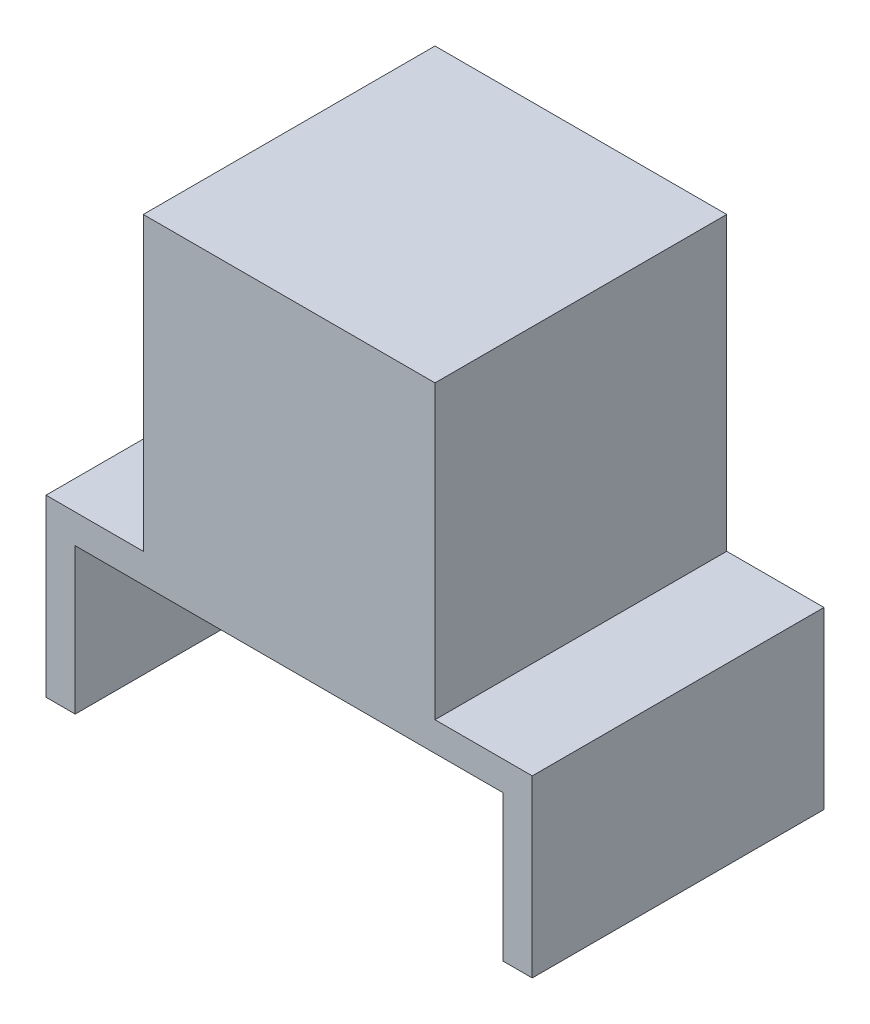
ISO-10303-21;
HEADER;
FILE_DESCRIPTION(('STEP AP214'),'2;1');
FILE_NAME('part.step','',(''),(''),'','','');
FILE_SCHEMA(('AUTOMOTIVE_DESIGN { 1 0 10303 214 1 1 1 1 }'));
ENDSEC;
DATA;
#1=APPLICATION_CONTEXT('core data for automotive mechanical design processes');
#2=APPLICATION_PROTOCOL_DEFINITION('international standard','automotive_design',2000,#1);
#3=PRODUCT_CONTEXT('',#1,'mechanical');
#4=PRODUCT('Part','Part','',(#3));
#5=PRODUCT_RELATED_PRODUCT_CATEGORY('part','',(#4));
#6=PRODUCT_DEFINITION_FORMATION('','',#4);
#7=PRODUCT_DEFINITION_CONTEXT('part definition',#1,'design');
#8=PRODUCT_DEFINITION('design','',#6,#7);
#9=PRODUCT_DEFINITION_SHAPE('','',#8);
#10=(LENGTH_UNIT() NAMED_UNIT(*) SI_UNIT(.MILLI.,.METRE.));
#11=(NAMED_UNIT(*) PLANE_ANGLE_UNIT() SI_UNIT($,.RADIAN.));
#12=(NAMED_UNIT(*) SI_UNIT($,.STERADIAN.) SOLID_ANGLE_UNIT());
#13=UNCERTAINTY_MEASURE_WITH_UNIT(LENGTH_MEASURE(1.E-05),#10,'distance_accuracy_value','');
#14=(GEOMETRIC_REPRESENTATION_CONTEXT(3) GLOBAL_UNCERTAINTY_ASSIGNED_CONTEXT((#13)) GLOBAL_UNIT_ASSIGNED_CONTEXT((#10,
#11,#12)) REPRESENTATION_CONTEXT('',''));
#15=CARTESIAN_POINT('',(0.,0.,0.));
#16=DIRECTION('',(0.,0.,1.));
#17=DIRECTION('',(1.,0.,0.));
#18=AXIS2_PLACEMENT_3D('',#15,#16,#17);
#19=CARTESIAN_POINT('',(0.,-14.4055944055944,0.));
#20=DIRECTION('',(0.,-1.,0.));
#21=DIRECTION('',(0.,0.,-1.));
#22=AXIS2_PLACEMENT_3D('',#19,#20,#21);
#23=PLANE('',#22);
#24=DIRECTION('',(0.,0.,-1.));
#25=VECTOR('',#24,1.);
#26=CARTESIAN_POINT('',(-18.041958041958,-14.4055944055944,40.));
#27=LINE('',#26,#25);
#28=CARTESIAN_POINT('',(-18.041958041958,-14.4055944055944,30.));
#29=VERTEX_POINT('',#28);
#30=CARTESIAN_POINT('',(-18.041958041958,-14.4055944055944,0.));
#31=VERTEX_POINT('',#30);
#32=EDGE_CURVE('E175',#29,#31,#27,.T.);
#33=ORIENTED_EDGE('',*,*,#32,.F.);
#34=DIRECTION('',(-1.,0.,0.));
#35=VECTOR('',#34,1.);
#36=CARTESIAN_POINT('',(31.958041958042,-14.4055944055944,30.));
#37=LINE('',#36,#35);
#38=CARTESIAN_POINT('',(-8.04195804195804,-14.4055944055944,30.));
#39=VERTEX_POINT('',#38);
#40=EDGE_CURVE('E220',#39,#29,#37,.T.);
#41=ORIENTED_EDGE('',*,*,#40,.F.);
#42=DIRECTION('',(0.,0.,-1.));
#43=VECTOR('',#42,1.);
#44=CARTESIAN_POINT('',(-8.04195804195803,-14.4055944055944,30.));
#45=LINE('',#44,#43);
#46=CARTESIAN_POINT('',(-8.04195804195803,-14.4055944055944,0.));
#47=VERTEX_POINT('',#46);
#48=EDGE_CURVE('E11',#39,#47,#45,.T.);
#49=ORIENTED_EDGE('',*,*,#48,.T.);
#50=DIRECTION('',(1.,0.,0.));
#51=VECTOR('',#50,1.);
#52=CARTESIAN_POINT('',(-18.041958041958,-14.4055944055944,0.));
#53=LINE('',#52,#51);
#54=EDGE_CURVE('E181',#31,#47,#53,.T.);
#55=ORIENTED_EDGE('',*,*,#54,.F.);
#56=EDGE_LOOP('',(#33,#41,#49,#55));
#57=FACE_BOUND('',#56,.T.);
#58=ADVANCED_FACE('F39',(#57),#23,.F.);
#59=CARTESIAN_POINT('',(0.,-17.4055944055944,0.));
#60=DIRECTION('',(0.,-1.,0.));
#61=DIRECTION('',(0.,0.,-1.));
#62=AXIS2_PLACEMENT_3D('',#59,#60,#61);
#63=PLANE('',#62);
#64=DIRECTION('',(1.,0.,0.));
#65=VECTOR('',#64,1.);
#66=CARTESIAN_POINT('',(0.,-17.4055944055944,30.));
#67=LINE('',#66,#65);
#68=CARTESIAN_POINT('',(-15.041958041958,-17.4055944055944,30.));
#69=VERTEX_POINT('',#68);
#70=CARTESIAN_POINT('',(28.958041958042,-17.4055944055944,30.));
#71=VERTEX_POINT('',#70);
#72=EDGE_CURVE('E225',#69,#71,#67,.T.);
#73=ORIENTED_EDGE('',*,*,#72,.F.);
#74=DIRECTION('',(0.,0.,1.));
#75=VECTOR('',#74,1.);
#76=CARTESIAN_POINT('',(-15.041958041958,-17.4055944055944,40.));
#77=LINE('',#76,#75);
#78=CARTESIAN_POINT('',(-15.041958041958,-17.4055944055944,0.));
#79=VERTEX_POINT('',#78);
#80=EDGE_CURVE('E162',#79,#69,#77,.T.);
#81=ORIENTED_EDGE('',*,*,#80,.F.);
#82=DIRECTION('',(1.,0.,0.));
#83=VECTOR('',#82,1.);
#84=CARTESIAN_POINT('',(-18.041958041958,-17.4055944055944,0.));
#85=LINE('',#84,#83);
#86=CARTESIAN_POINT('',(28.958041958042,-17.4055944055944,0.));
#87=VERTEX_POINT('',#86);
#88=EDGE_CURVE('E176',#79,#87,#85,.T.);
#89=ORIENTED_EDGE('',*,*,#88,.T.);
#90=DIRECTION('',(0.,0.,-1.));
#91=VECTOR('',#90,1.);
#92=CARTESIAN_POINT('',(28.958041958042,-17.4055944055944,0.));
#93=LINE('',#92,#91);
#94=EDGE_CURVE('E61',#71,#87,#93,.T.);
#95=ORIENTED_EDGE('',*,*,#94,.F.);
#96=EDGE_LOOP('',(#73,#81,#89,#95));
#97=FACE_BOUND('',#96,.T.);
#98=ADVANCED_FACE('F246',(#97),#63,.T.);
#99=CARTESIAN_POINT('',(-8.04195804195804,15.5944055944056,30.));
#100=DIRECTION('',(1.,0.,0.));
#101=DIRECTION('',(0.,1.,0.));
#102=AXIS2_PLACEMENT_3D('',#99,#100,#101);
#103=PLANE('',#102);
#104=DIRECTION('',(0.,-1.,0.));
#105=VECTOR('',#104,1.);
#106=CARTESIAN_POINT('',(-8.04195804195804,15.5944055944056,0.));
#107=LINE('',#106,#105);
#108=CARTESIAN_POINT('',(-8.04195804195804,15.5944055944056,0.));
#109=VERTEX_POINT('',#108);
#110=EDGE_CURVE('E189',#109,#47,#107,.T.);
#111=ORIENTED_EDGE('',*,*,#110,.T.);
#112=ORIENTED_EDGE('',*,*,#48,.F.);
#113=DIRECTION('',(0.,-1.,0.));
#114=VECTOR('',#113,1.);
#115=CARTESIAN_POINT('',(-8.04195804195804,15.5944055944056,30.));
#116=LINE('',#115,#114);
#117=CARTESIAN_POINT('',(-8.04195804195804,15.5944055944056,30.));
#118=VERTEX_POINT('',#117);
#119=EDGE_CURVE('E190',#118,#39,#116,.T.);
#120=ORIENTED_EDGE('',*,*,#119,.F.);
#121=DIRECTION('',(0.,0.,-1.));
#122=VECTOR('',#121,1.);
#123=CARTESIAN_POINT('',(-8.04195804195804,15.5944055944056,30.));
#124=LINE('',#123,#122);
#125=EDGE_CURVE('E197',#118,#109,#124,.T.);
#126=ORIENTED_EDGE('',*,*,#125,.T.);
#127=EDGE_LOOP('',(#111,#112,#120,#126));
#128=FACE_BOUND('',#127,.T.);
#129=ADVANCED_FACE('F41',(#128),#103,.F.);
#130=CARTESIAN_POINT('',(21.958041958042,15.5944055944056,30.));
#131=DIRECTION('',(-1.,0.,0.));
#132=DIRECTION('',(0.,-1.,0.));
#133=AXIS2_PLACEMENT_3D('',#130,#131,#132);
#134=PLANE('',#133);
#135=DIRECTION('',(0.,1.,0.));
#136=VECTOR('',#135,1.);
#137=CARTESIAN_POINT('',(21.958041958042,15.5944055944056,0.));
#138=LINE('',#137,#136);
#139=CARTESIAN_POINT('',(21.958041958042,-14.4055944055944,0.));
#140=VERTEX_POINT('',#139);
#141=CARTESIAN_POINT('',(21.958041958042,15.5944055944056,0.));
#142=VERTEX_POINT('',#141);
#143=EDGE_CURVE('E199',#140,#142,#138,.T.);
#144=ORIENTED_EDGE('',*,*,#143,.T.);
#145=DIRECTION('',(0.,0.,-1.));
#146=VECTOR('',#145,1.);
#147=CARTESIAN_POINT('',(21.958041958042,15.5944055944056,30.));
#148=LINE('',#147,#146);
#149=CARTESIAN_POINT('',(21.958041958042,15.5944055944056,30.));
#150=VERTEX_POINT('',#149);
#151=EDGE_CURVE('E204',#150,#142,#148,.T.);
#152=ORIENTED_EDGE('',*,*,#151,.F.);
#153=DIRECTION('',(0.,1.,0.));
#154=VECTOR('',#153,1.);
#155=CARTESIAN_POINT('',(21.958041958042,15.5944055944056,30.));
#156=LINE('',#155,#154);
#157=CARTESIAN_POINT('',(21.958041958042,-14.4055944055944,30.));
#158=VERTEX_POINT('',#157);
#159=EDGE_CURVE('E192',#158,#150,#156,.T.);
#160=ORIENTED_EDGE('',*,*,#159,.F.);
#161=DIRECTION('',(0.,0.,-1.));
#162=VECTOR('',#161,1.);
#163=CARTESIAN_POINT('',(21.958041958042,-14.4055944055944,30.));
#164=LINE('',#163,#162);
#165=EDGE_CURVE('E47',#158,#140,#164,.T.);
#166=ORIENTED_EDGE('',*,*,#165,.T.);
#167=EDGE_LOOP('',(#144,#152,#160,#166));
#168=FACE_BOUND('',#167,.T.);
#169=ADVANCED_FACE('F210',(#168),#134,.F.);
#170=CARTESIAN_POINT('',(-8.04195804195804,15.5944055944056,30.));
#171=DIRECTION('',(0.,-1.,0.));
#172=DIRECTION('',(0.,0.,-1.));
#173=AXIS2_PLACEMENT_3D('',#170,#171,#172);
#174=PLANE('',#173);
#175=DIRECTION('',(-1.,0.,0.));
#176=VECTOR('',#175,1.);
#177=CARTESIAN_POINT('',(-8.04195804195804,15.5944055944056,0.));
#178=LINE('',#177,#176);
#179=EDGE_CURVE('E193',#142,#109,#178,.T.);
#180=ORIENTED_EDGE('',*,*,#179,.T.);
#181=ORIENTED_EDGE('',*,*,#125,.F.);
#182=DIRECTION('',(-1.,0.,0.));
#183=VECTOR('',#182,1.);
#184=CARTESIAN_POINT('',(-8.04195804195804,15.5944055944056,30.));
#185=LINE('',#184,#183);
#186=EDGE_CURVE('E195',#150,#118,#185,.T.);
#187=ORIENTED_EDGE('',*,*,#186,.F.);
#188=ORIENTED_EDGE('',*,*,#151,.T.);
#189=EDGE_LOOP('',(#180,#181,#187,#188));
#190=FACE_BOUND('',#189,.T.);
#191=ADVANCED_FACE('F270',(#190),#174,.F.);
#192=CARTESIAN_POINT('',(0.,0.,30.));
#193=DIRECTION('',(0.,0.,1.));
#194=DIRECTION('',(1.,0.,0.));
#195=AXIS2_PLACEMENT_3D('',#192,#193,#194);
#196=PLANE('',#195);
#197=ORIENTED_EDGE('',*,*,#119,.T.);
#198=ORIENTED_EDGE('',*,*,#40,.T.);
#199=DIRECTION('',(0.,1.,0.));
#200=VECTOR('',#199,1.);
#201=CARTESIAN_POINT('',(-18.041958041958,-17.4055944055944,30.));
#202=LINE('',#201,#200);
#203=CARTESIAN_POINT('',(-18.041958041958,-32.4055944055944,30.));
#204=VERTEX_POINT('',#203);
#205=EDGE_CURVE('E153',#204,#29,#202,.T.);
#206=ORIENTED_EDGE('',*,*,#205,.F.);
#207=DIRECTION('',(-1.,0.,0.));
#208=VECTOR('',#207,1.);
#209=CARTESIAN_POINT('',(31.958041958042,-32.4055944055944,30.));
#210=LINE('',#209,#208);
#211=CARTESIAN_POINT('',(-15.041958041958,-32.4055944055944,30.));
#212=VERTEX_POINT('',#211);
#213=EDGE_CURVE('E135',#212,#204,#210,.T.);
#214=ORIENTED_EDGE('',*,*,#213,.F.);
#215=DIRECTION('',(0.,-1.,0.));
#216=VECTOR('',#215,1.);
#217=CARTESIAN_POINT('',(-15.041958041958,-32.4055944055944,30.));
#218=LINE('',#217,#216);
#219=EDGE_CURVE('E226',#69,#212,#218,.T.);
#220=ORIENTED_EDGE('',*,*,#219,.F.);
#221=ORIENTED_EDGE('',*,*,#72,.T.);
#222=DIRECTION('',(0.,1.,0.));
#223=VECTOR('',#222,1.);
#224=CARTESIAN_POINT('',(28.958041958042,-32.4055944055944,30.));
#225=LINE('',#224,#223);
#226=CARTESIAN_POINT('',(28.958041958042,-32.4055944055944,30.));
#227=VERTEX_POINT('',#226);
#228=EDGE_CURVE('E54',#227,#71,#225,.T.);
#229=ORIENTED_EDGE('',*,*,#228,.F.);
#230=CARTESIAN_POINT('',(31.958041958042,-32.4055944055944,30.));
#231=VERTEX_POINT('',#230);
#232=EDGE_CURVE('E126',#231,#227,#210,.T.);
#233=ORIENTED_EDGE('',*,*,#232,.F.);
#234=DIRECTION('',(0.,1.,0.));
#235=VECTOR('',#234,1.);
#236=CARTESIAN_POINT('',(31.958041958042,-32.4055944055944,30.));
#237=LINE('',#236,#235);
#238=CARTESIAN_POINT('',(31.958041958042,-14.4055944055944,30.));
#239=VERTEX_POINT('',#238);
#240=EDGE_CURVE('E130',#231,#239,#237,.T.);
#241=ORIENTED_EDGE('',*,*,#240,.T.);
#242=EDGE_CURVE('E219',#239,#158,#37,.T.);
#243=ORIENTED_EDGE('',*,*,#242,.T.);
#244=ORIENTED_EDGE('',*,*,#159,.T.);
#245=ORIENTED_EDGE('',*,*,#186,.T.);
#246=EDGE_LOOP('',(#197,#198,#206,#214,#220,#221,#229,#233,#241,#243,#244,#245));
#247=FACE_BOUND('',#246,.T.);
#248=ADVANCED_FACE('F129',(#247),#196,.T.);
#249=CARTESIAN_POINT('',(0.,0.,0.));
#250=DIRECTION('',(0.,0.,1.));
#251=DIRECTION('',(1.,0.,0.));
#252=AXIS2_PLACEMENT_3D('',#249,#250,#251);
#253=PLANE('',#252);
#254=ORIENTED_EDGE('',*,*,#110,.F.);
#255=ORIENTED_EDGE('',*,*,#179,.F.);
#256=ORIENTED_EDGE('',*,*,#143,.F.);
#257=CARTESIAN_POINT('',(31.958041958042,-14.4055944055944,0.));
#258=VERTEX_POINT('',#257);
#259=EDGE_CURVE('E180',#140,#258,#53,.T.);
#260=ORIENTED_EDGE('',*,*,#259,.T.);
#261=DIRECTION('',(0.,1.,0.));
#262=VECTOR('',#261,1.);
#263=CARTESIAN_POINT('',(31.958041958042,-17.4055944055944,0.));
#264=LINE('',#263,#262);
#265=CARTESIAN_POINT('',(31.958041958042,-32.4055944055944,0.));
#266=VERTEX_POINT('',#265);
#267=EDGE_CURVE('E178',#266,#258,#264,.T.);
#268=ORIENTED_EDGE('',*,*,#267,.F.);
#269=DIRECTION('',(1.,0.,0.));
#270=VECTOR('',#269,1.);
#271=CARTESIAN_POINT('',(31.958041958042,-32.4055944055944,0.));
#272=LINE('',#271,#270);
#273=CARTESIAN_POINT('',(28.958041958042,-32.4055944055944,0.));
#274=VERTEX_POINT('',#273);
#275=EDGE_CURVE('E149',#274,#266,#272,.T.);
#276=ORIENTED_EDGE('',*,*,#275,.F.);
#277=DIRECTION('',(0.,1.,0.));
#278=VECTOR('',#277,1.);
#279=CARTESIAN_POINT('',(28.958041958042,-32.4055944055944,0.));
#280=LINE('',#279,#278);
#281=EDGE_CURVE('E158',#274,#87,#280,.T.);
#282=ORIENTED_EDGE('',*,*,#281,.T.);
#283=ORIENTED_EDGE('',*,*,#88,.F.);
#284=DIRECTION('',(0.,1.,0.));
#285=VECTOR('',#284,1.);
#286=CARTESIAN_POINT('',(-15.041958041958,-32.4055944055944,0.));
#287=LINE('',#286,#285);
#288=CARTESIAN_POINT('',(-15.041958041958,-32.4055944055944,0.));
#289=VERTEX_POINT('',#288);
#290=EDGE_CURVE('E170',#289,#79,#287,.T.);
#291=ORIENTED_EDGE('',*,*,#290,.F.);
#292=DIRECTION('',(1.,0.,0.));
#293=VECTOR('',#292,1.);
#294=CARTESIAN_POINT('',(-18.041958041958,-32.4055944055944,0.));
#295=LINE('',#294,#293);
#296=CARTESIAN_POINT('',(-18.041958041958,-32.4055944055944,0.));
#297=VERTEX_POINT('',#296);
#298=EDGE_CURVE('E165',#297,#289,#295,.T.);
#299=ORIENTED_EDGE('',*,*,#298,.F.);
#300=DIRECTION('',(0.,1.,0.));
#301=VECTOR('',#300,1.);
#302=CARTESIAN_POINT('',(-18.041958041958,-17.4055944055944,0.));
#303=LINE('',#302,#301);
#304=EDGE_CURVE('E186',#297,#31,#303,.T.);
#305=ORIENTED_EDGE('',*,*,#304,.T.);
#306=ORIENTED_EDGE('',*,*,#54,.T.);
#307=EDGE_LOOP('',(#254,#255,#256,#260,#268,#276,#282,#283,#291,#299,#305,#306));
#308=FACE_BOUND('',#307,.T.);
#309=ADVANCED_FACE('F217',(#308),#253,.F.);
#310=CARTESIAN_POINT('',(-18.041958041958,-17.4055944055944,40.));
#311=DIRECTION('',(1.,0.,0.));
#312=DIRECTION('',(0.,0.,-1.));
#313=AXIS2_PLACEMENT_3D('',#310,#311,#312);
#314=PLANE('',#313);
#315=DIRECTION('',(0.,0.,-1.));
#316=VECTOR('',#315,1.);
#317=CARTESIAN_POINT('',(-18.041958041958,-32.4055944055944,40.));
#318=LINE('',#317,#316);
#319=EDGE_CURVE('E163',#204,#297,#318,.T.);
#320=ORIENTED_EDGE('',*,*,#319,.F.);
#321=ORIENTED_EDGE('',*,*,#205,.T.);
#322=ORIENTED_EDGE('',*,*,#32,.T.);
#323=ORIENTED_EDGE('',*,*,#304,.F.);
#324=EDGE_LOOP('',(#320,#321,#322,#323));
#325=FACE_BOUND('',#324,.T.);
#326=ADVANCED_FACE('F234',(#325),#314,.F.);
#327=CARTESIAN_POINT('',(31.958041958042,-17.4055944055944,40.));
#328=DIRECTION('',(-1.,0.,0.));
#329=DIRECTION('',(0.,0.,1.));
#330=AXIS2_PLACEMENT_3D('',#327,#328,#329);
#331=PLANE('',#330);
#332=DIRECTION('',(0.,0.,1.));
#333=VECTOR('',#332,1.);
#334=CARTESIAN_POINT('',(31.958041958042,-14.4055944055944,40.));
#335=LINE('',#334,#333);
#336=EDGE_CURVE('E144',#258,#239,#335,.T.);
#337=ORIENTED_EDGE('',*,*,#336,.T.);
#338=ORIENTED_EDGE('',*,*,#240,.F.);
#339=DIRECTION('',(0.,0.,1.));
#340=VECTOR('',#339,1.);
#341=CARTESIAN_POINT('',(31.958041958042,-32.4055944055944,0.));
#342=LINE('',#341,#340);
#343=EDGE_CURVE('E142',#266,#231,#342,.T.);
#344=ORIENTED_EDGE('',*,*,#343,.F.);
#345=ORIENTED_EDGE('',*,*,#267,.T.);
#346=EDGE_LOOP('',(#337,#338,#344,#345));
#347=FACE_BOUND('',#346,.T.);
#348=ADVANCED_FACE('F140',(#347),#331,.F.);
#349=ORIENTED_EDGE('',*,*,#165,.F.);
#350=ORIENTED_EDGE('',*,*,#242,.F.);
#351=ORIENTED_EDGE('',*,*,#336,.F.);
#352=ORIENTED_EDGE('',*,*,#259,.F.);
#353=EDGE_LOOP('',(#349,#350,#351,#352));
#354=FACE_BOUND('',#353,.T.);
#355=ADVANCED_FACE('F218',(#354),#23,.F.);
#356=CARTESIAN_POINT('',(-15.041958041958,-32.4055944055944,40.));
#357=DIRECTION('',(-1.,0.,0.));
#358=DIRECTION('',(0.,0.,1.));
#359=AXIS2_PLACEMENT_3D('',#356,#357,#358);
#360=PLANE('',#359);
#361=ORIENTED_EDGE('',*,*,#80,.T.);
#362=ORIENTED_EDGE('',*,*,#219,.T.);
#363=DIRECTION('',(0.,0.,1.));
#364=VECTOR('',#363,1.);
#365=CARTESIAN_POINT('',(-15.041958041958,-32.4055944055944,40.));
#366=LINE('',#365,#364);
#367=EDGE_CURVE('E167',#289,#212,#366,.T.);
#368=ORIENTED_EDGE('',*,*,#367,.F.);
#369=ORIENTED_EDGE('',*,*,#290,.T.);
#370=EDGE_LOOP('',(#361,#362,#368,#369));
#371=FACE_BOUND('',#370,.T.);
#372=ADVANCED_FACE('F247',(#371),#360,.F.);
#373=CARTESIAN_POINT('',(0.,-32.4055944055944,0.));
#374=DIRECTION('',(0.,-1.,0.));
#375=DIRECTION('',(0.,0.,-1.));
#376=AXIS2_PLACEMENT_3D('',#373,#374,#375);
#377=PLANE('',#376);
#378=ORIENTED_EDGE('',*,*,#213,.T.);
#379=ORIENTED_EDGE('',*,*,#319,.T.);
#380=ORIENTED_EDGE('',*,*,#298,.T.);
#381=ORIENTED_EDGE('',*,*,#367,.T.);
#382=EDGE_LOOP('',(#378,#379,#380,#381));
#383=FACE_BOUND('',#382,.T.);
#384=ADVANCED_FACE('F243',(#383),#377,.T.);
#385=CARTESIAN_POINT('',(28.958041958042,-32.4055944055944,0.));
#386=DIRECTION('',(1.,0.,0.));
#387=DIRECTION('',(0.,0.,-1.));
#388=AXIS2_PLACEMENT_3D('',#385,#386,#387);
#389=PLANE('',#388);
#390=DIRECTION('',(0.,0.,-1.));
#391=VECTOR('',#390,1.);
#392=CARTESIAN_POINT('',(28.958041958042,-32.4055944055944,0.));
#393=LINE('',#392,#391);
#394=EDGE_CURVE('E150',#227,#274,#393,.T.);
#395=ORIENTED_EDGE('',*,*,#394,.F.);
#396=ORIENTED_EDGE('',*,*,#228,.T.);
#397=ORIENTED_EDGE('',*,*,#94,.T.);
#398=ORIENTED_EDGE('',*,*,#281,.F.);
#399=EDGE_LOOP('',(#395,#396,#397,#398));
#400=FACE_BOUND('',#399,.T.);
#401=ADVANCED_FACE('F254',(#400),#389,.F.);
#402=CARTESIAN_POINT('',(0.,-32.4055944055944,0.));
#403=DIRECTION('',(0.,-1.,0.));
#404=DIRECTION('',(0.,0.,-1.));
#405=AXIS2_PLACEMENT_3D('',#402,#403,#404);
#406=PLANE('',#405);
#407=ORIENTED_EDGE('',*,*,#232,.T.);
#408=ORIENTED_EDGE('',*,*,#394,.T.);
#409=ORIENTED_EDGE('',*,*,#275,.T.);
#410=ORIENTED_EDGE('',*,*,#343,.T.);
#411=EDGE_LOOP('',(#407,#408,#409,#410));
#412=FACE_BOUND('',#411,.T.);
#413=ADVANCED_FACE('F147',(#412),#406,.T.);
#414=CLOSED_SHELL('',(#58,#98,#129,#169,#191,#248,#309,#326,#348,#355,#372,#384,#401,#413));
#415=MANIFOLD_SOLID_BREP('B2',#414);
#416=ADVANCED_BREP_SHAPE_REPRESENTATION('',(#18,#415),#14);
#417=SHAPE_DEFINITION_REPRESENTATION(#9,#416);
ENDSEC;
END-ISO-10303-21;
